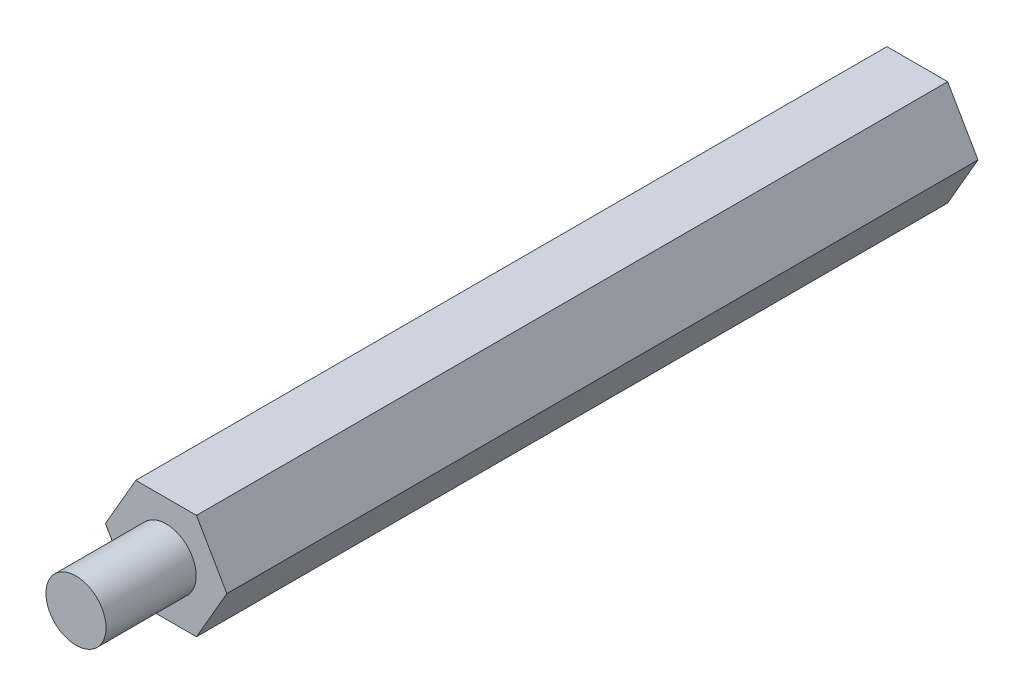
ISO-10303-21;
HEADER;
FILE_DESCRIPTION(('STEP AP214'),'2;1');
FILE_NAME('part.step','',(''),(''),'','','');
FILE_SCHEMA(('AUTOMOTIVE_DESIGN { 1 0 10303 214 1 1 1 1 }'));
ENDSEC;
DATA;
#1=APPLICATION_CONTEXT('core data for automotive mechanical design processes');
#2=APPLICATION_PROTOCOL_DEFINITION('international standard','automotive_design',2000,#1);
#3=PRODUCT_CONTEXT('',#1,'mechanical');
#4=PRODUCT('Part','Part','',(#3));
#5=PRODUCT_RELATED_PRODUCT_CATEGORY('part','',(#4));
#6=PRODUCT_DEFINITION_FORMATION('','',#4);
#7=PRODUCT_DEFINITION_CONTEXT('part definition',#1,'design');
#8=PRODUCT_DEFINITION('design','',#6,#7);
#9=PRODUCT_DEFINITION_SHAPE('','',#8);
#10=(LENGTH_UNIT() NAMED_UNIT(*) SI_UNIT(.MILLI.,.METRE.));
#11=(NAMED_UNIT(*) PLANE_ANGLE_UNIT() SI_UNIT($,.RADIAN.));
#12=(NAMED_UNIT(*) SI_UNIT($,.STERADIAN.) SOLID_ANGLE_UNIT());
#13=UNCERTAINTY_MEASURE_WITH_UNIT(LENGTH_MEASURE(1.E-05),#10,'distance_accuracy_value','');
#14=(GEOMETRIC_REPRESENTATION_CONTEXT(3) GLOBAL_UNCERTAINTY_ASSIGNED_CONTEXT((#13)) GLOBAL_UNIT_ASSIGNED_CONTEXT((#10,
#11,#12)) REPRESENTATION_CONTEXT('',''));
#15=CARTESIAN_POINT('',(0.,0.,0.));
#16=DIRECTION('',(0.,0.,1.));
#17=DIRECTION('',(1.,0.,0.));
#18=AXIS2_PLACEMENT_3D('',#15,#16,#17);
#19=CARTESIAN_POINT('',(2.02072594216373,-3.49999999999998,50.));
#20=DIRECTION('',(-0.866025403784442,0.499999999999995,0.));
#21=DIRECTION('',(-0.499999999999995,-0.866025403784442,0.));
#22=AXIS2_PLACEMENT_3D('',#19,#20,#21);
#23=PLANE('',#22);
#24=DIRECTION('',(0.499999999999995,0.866025403784442,0.));
#25=VECTOR('',#24,1.);
#26=CARTESIAN_POINT('',(2.02072594216373,-3.49999999999998,0.));
#27=LINE('',#26,#25);
#28=CARTESIAN_POINT('',(2.02072594216373,-3.49999999999998,0.));
#29=VERTEX_POINT('',#28);
#30=CARTESIAN_POINT('',(4.04145188432738,0.,0.));
#31=VERTEX_POINT('',#30);
#32=EDGE_CURVE('E126',#29,#31,#27,.T.);
#33=ORIENTED_EDGE('',*,*,#32,.T.);
#34=DIRECTION('',(0.,0.,-1.));
#35=VECTOR('',#34,1.);
#36=CARTESIAN_POINT('',(4.04145188432738,0.,50.));
#37=LINE('',#36,#35);
#38=CARTESIAN_POINT('',(4.04145188432738,0.,50.));
#39=VERTEX_POINT('',#38);
#40=EDGE_CURVE('E41',#39,#31,#37,.T.);
#41=ORIENTED_EDGE('',*,*,#40,.F.);
#42=DIRECTION('',(0.499999999999995,0.866025403784442,0.));
#43=VECTOR('',#42,1.);
#44=CARTESIAN_POINT('',(2.02072594216373,-3.49999999999998,50.));
#45=LINE('',#44,#43);
#46=CARTESIAN_POINT('',(2.02072594216373,-3.49999999999998,50.));
#47=VERTEX_POINT('',#46);
#48=EDGE_CURVE('E137',#47,#39,#45,.T.);
#49=ORIENTED_EDGE('',*,*,#48,.F.);
#50=DIRECTION('',(0.,0.,-1.));
#51=VECTOR('',#50,1.);
#52=CARTESIAN_POINT('',(2.02072594216373,-3.49999999999998,50.));
#53=LINE('',#52,#51);
#54=EDGE_CURVE('E122',#47,#29,#53,.T.);
#55=ORIENTED_EDGE('',*,*,#54,.T.);
#56=EDGE_LOOP('',(#33,#41,#49,#55));
#57=FACE_BOUND('',#56,.T.);
#58=ADVANCED_FACE('F38',(#57),#23,.F.);
#59=CARTESIAN_POINT('',(4.04145188432738,0.,50.));
#60=DIRECTION('',(-0.866025403784438,-0.500000000000001,0.));
#61=DIRECTION('',(0.500000000000001,-0.866025403784438,0.));
#62=AXIS2_PLACEMENT_3D('',#59,#60,#61);
#63=PLANE('',#62);
#64=DIRECTION('',(-0.500000000000001,0.866025403784438,0.));
#65=VECTOR('',#64,1.);
#66=CARTESIAN_POINT('',(4.04145188432738,0.,0.));
#67=LINE('',#66,#65);
#68=CARTESIAN_POINT('',(2.02072594216368,3.50000000000001,0.));
#69=VERTEX_POINT('',#68);
#70=EDGE_CURVE('E129',#31,#69,#67,.T.);
#71=ORIENTED_EDGE('',*,*,#70,.T.);
#72=DIRECTION('',(0.,0.,-1.));
#73=VECTOR('',#72,1.);
#74=CARTESIAN_POINT('',(2.02072594216368,3.50000000000001,50.));
#75=LINE('',#74,#73);
#76=CARTESIAN_POINT('',(2.02072594216368,3.50000000000001,50.));
#77=VERTEX_POINT('',#76);
#78=EDGE_CURVE('E140',#77,#69,#75,.T.);
#79=ORIENTED_EDGE('',*,*,#78,.F.);
#80=DIRECTION('',(-0.500000000000001,0.866025403784438,0.));
#81=VECTOR('',#80,1.);
#82=CARTESIAN_POINT('',(4.04145188432738,0.,50.));
#83=LINE('',#82,#81);
#84=EDGE_CURVE('E94',#39,#77,#83,.T.);
#85=ORIENTED_EDGE('',*,*,#84,.F.);
#86=ORIENTED_EDGE('',*,*,#40,.T.);
#87=EDGE_LOOP('',(#71,#79,#85,#86));
#88=FACE_BOUND('',#87,.T.);
#89=ADVANCED_FACE('F145',(#88),#63,.F.);
#90=CARTESIAN_POINT('',(2.02072594216368,3.50000000000001,50.));
#91=DIRECTION('',(0.,-1.,0.));
#92=DIRECTION('',(1.,0.,0.));
#93=AXIS2_PLACEMENT_3D('',#90,#91,#92);
#94=PLANE('',#93);
#95=DIRECTION('',(-1.,0.,0.));
#96=VECTOR('',#95,1.);
#97=CARTESIAN_POINT('',(2.02072594216368,3.50000000000001,0.));
#98=LINE('',#97,#96);
#99=CARTESIAN_POINT('',(-2.02072594216371,3.49999999999999,0.));
#100=VERTEX_POINT('',#99);
#101=EDGE_CURVE('E132',#69,#100,#98,.T.);
#102=ORIENTED_EDGE('',*,*,#101,.T.);
#103=DIRECTION('',(0.,0.,-1.));
#104=VECTOR('',#103,1.);
#105=CARTESIAN_POINT('',(-2.02072594216371,3.49999999999999,50.));
#106=LINE('',#105,#104);
#107=CARTESIAN_POINT('',(-2.02072594216371,3.49999999999999,50.));
#108=VERTEX_POINT('',#107);
#109=EDGE_CURVE('E117',#108,#100,#106,.T.);
#110=ORIENTED_EDGE('',*,*,#109,.F.);
#111=DIRECTION('',(-1.,0.,0.));
#112=VECTOR('',#111,1.);
#113=CARTESIAN_POINT('',(2.02072594216368,3.50000000000001,50.));
#114=LINE('',#113,#112);
#115=EDGE_CURVE('E108',#77,#108,#114,.T.);
#116=ORIENTED_EDGE('',*,*,#115,.F.);
#117=ORIENTED_EDGE('',*,*,#78,.T.);
#118=EDGE_LOOP('',(#102,#110,#116,#117));
#119=FACE_BOUND('',#118,.T.);
#120=ADVANCED_FACE('F151',(#119),#94,.F.);
#121=CARTESIAN_POINT('',(-2.02072594216371,3.49999999999999,50.));
#122=DIRECTION('',(0.866025403784442,-0.499999999999995,0.));
#123=DIRECTION('',(0.499999999999995,0.866025403784442,0.));
#124=AXIS2_PLACEMENT_3D('',#121,#122,#123);
#125=PLANE('',#124);
#126=DIRECTION('',(-0.499999999999995,-0.866025403784442,0.));
#127=VECTOR('',#126,1.);
#128=CARTESIAN_POINT('',(-2.02072594216371,3.49999999999999,0.));
#129=LINE('',#128,#127);
#130=CARTESIAN_POINT('',(-4.04145188432738,0.,0.));
#131=VERTEX_POINT('',#130);
#132=EDGE_CURVE('E116',#100,#131,#129,.T.);
#133=ORIENTED_EDGE('',*,*,#132,.T.);
#134=DIRECTION('',(0.,0.,-1.));
#135=VECTOR('',#134,1.);
#136=CARTESIAN_POINT('',(-4.04145188432738,0.,50.));
#137=LINE('',#136,#135);
#138=CARTESIAN_POINT('',(-4.04145188432738,0.,50.));
#139=VERTEX_POINT('',#138);
#140=EDGE_CURVE('E113',#139,#131,#137,.T.);
#141=ORIENTED_EDGE('',*,*,#140,.F.);
#142=DIRECTION('',(-0.499999999999995,-0.866025403784442,0.));
#143=VECTOR('',#142,1.);
#144=CARTESIAN_POINT('',(-2.02072594216371,3.49999999999999,50.));
#145=LINE('',#144,#143);
#146=EDGE_CURVE('E102',#108,#139,#145,.T.);
#147=ORIENTED_EDGE('',*,*,#146,.F.);
#148=ORIENTED_EDGE('',*,*,#109,.T.);
#149=EDGE_LOOP('',(#133,#141,#147,#148));
#150=FACE_BOUND('',#149,.T.);
#151=ADVANCED_FACE('F114',(#150),#125,.F.);
#152=CARTESIAN_POINT('',(-4.04145188432738,0.,50.));
#153=DIRECTION('',(0.866025403784435,0.500000000000007,0.));
#154=DIRECTION('',(-0.500000000000007,0.866025403784435,0.));
#155=AXIS2_PLACEMENT_3D('',#152,#153,#154);
#156=PLANE('',#155);
#157=DIRECTION('',(0.500000000000007,-0.866025403784435,0.));
#158=VECTOR('',#157,1.);
#159=CARTESIAN_POINT('',(-4.04145188432738,0.,0.));
#160=LINE('',#159,#158);
#161=CARTESIAN_POINT('',(-2.02072594216366,-3.50000000000002,0.));
#162=VERTEX_POINT('',#161);
#163=EDGE_CURVE('E79',#131,#162,#160,.T.);
#164=ORIENTED_EDGE('',*,*,#163,.T.);
#165=DIRECTION('',(0.,0.,-1.));
#166=VECTOR('',#165,1.);
#167=CARTESIAN_POINT('',(-2.02072594216366,-3.50000000000002,50.));
#168=LINE('',#167,#166);
#169=CARTESIAN_POINT('',(-2.02072594216366,-3.50000000000002,50.));
#170=VERTEX_POINT('',#169);
#171=EDGE_CURVE('E118',#170,#162,#168,.T.);
#172=ORIENTED_EDGE('',*,*,#171,.F.);
#173=DIRECTION('',(0.500000000000007,-0.866025403784435,0.));
#174=VECTOR('',#173,1.);
#175=CARTESIAN_POINT('',(-4.04145188432738,0.,50.));
#176=LINE('',#175,#174);
#177=EDGE_CURVE('E106',#139,#170,#176,.T.);
#178=ORIENTED_EDGE('',*,*,#177,.F.);
#179=ORIENTED_EDGE('',*,*,#140,.T.);
#180=EDGE_LOOP('',(#164,#172,#178,#179));
#181=FACE_BOUND('',#180,.T.);
#182=ADVANCED_FACE('F120',(#181),#156,.F.);
#183=CARTESIAN_POINT('',(-2.02072594216366,-3.50000000000002,50.));
#184=DIRECTION('',(0.,1.,0.));
#185=DIRECTION('',(-1.,0.,0.));
#186=AXIS2_PLACEMENT_3D('',#183,#184,#185);
#187=PLANE('',#186);
#188=DIRECTION('',(1.,0.,0.));
#189=VECTOR('',#188,1.);
#190=CARTESIAN_POINT('',(-2.02072594216366,-3.50000000000002,0.));
#191=LINE('',#190,#189);
#192=EDGE_CURVE('E85',#162,#29,#191,.T.);
#193=ORIENTED_EDGE('',*,*,#192,.T.);
#194=ORIENTED_EDGE('',*,*,#54,.F.);
#195=DIRECTION('',(1.,0.,0.));
#196=VECTOR('',#195,1.);
#197=CARTESIAN_POINT('',(-2.02072594216366,-3.50000000000002,50.));
#198=LINE('',#197,#196);
#199=EDGE_CURVE('E55',#170,#47,#198,.T.);
#200=ORIENTED_EDGE('',*,*,#199,.F.);
#201=ORIENTED_EDGE('',*,*,#171,.T.);
#202=EDGE_LOOP('',(#193,#194,#200,#201));
#203=FACE_BOUND('',#202,.T.);
#204=ADVANCED_FACE('F176',(#203),#187,.F.);
#205=CARTESIAN_POINT('',(0.,0.,50.));
#206=DIRECTION('',(0.,0.,1.));
#207=DIRECTION('',(1.,0.,0.));
#208=AXIS2_PLACEMENT_3D('',#205,#206,#207);
#209=PLANE('',#208);
#210=CARTESIAN_POINT('',(0.,0.,50.));
#211=DIRECTION('',(0.,0.,1.));
#212=DIRECTION('',(1.,0.,0.));
#213=AXIS2_PLACEMENT_3D('',#210,#211,#212);
#214=CIRCLE('',#213,2.);
#215=CARTESIAN_POINT('',(2.,0.,50.));
#216=VERTEX_POINT('',#215);
#217=EDGE_CURVE('E11',#216,#216,#214,.T.);
#218=ORIENTED_EDGE('',*,*,#217,.F.);
#219=EDGE_LOOP('',(#218));
#220=FACE_BOUND('',#219,.T.);
#221=ORIENTED_EDGE('',*,*,#48,.T.);
#222=ORIENTED_EDGE('',*,*,#84,.T.);
#223=ORIENTED_EDGE('',*,*,#115,.T.);
#224=ORIENTED_EDGE('',*,*,#146,.T.);
#225=ORIENTED_EDGE('',*,*,#177,.T.);
#226=ORIENTED_EDGE('',*,*,#199,.T.);
#227=EDGE_LOOP('',(#221,#222,#223,#224,#225,#226));
#228=FACE_BOUND('',#227,.T.);
#229=ADVANCED_FACE('F104',(#220,#228),#209,.T.);
#230=CARTESIAN_POINT('',(0.,0.,0.));
#231=DIRECTION('',(0.,0.,1.));
#232=DIRECTION('',(1.,0.,0.));
#233=AXIS2_PLACEMENT_3D('',#230,#231,#232);
#234=PLANE('',#233);
#235=CARTESIAN_POINT('',(0.,0.,0.));
#236=DIRECTION('',(0.,0.,-1.));
#237=DIRECTION('',(-1.,0.,0.));
#238=AXIS2_PLACEMENT_3D('',#235,#236,#237);
#239=CIRCLE('',#238,1.64999999999999);
#240=CARTESIAN_POINT('',(-1.64999999999999,0.,0.));
#241=VERTEX_POINT('',#240);
#242=EDGE_CURVE('E160',#241,#241,#239,.T.);
#243=ORIENTED_EDGE('',*,*,#242,.F.);
#244=EDGE_LOOP('',(#243));
#245=FACE_BOUND('',#244,.T.);
#246=ORIENTED_EDGE('',*,*,#32,.F.);
#247=ORIENTED_EDGE('',*,*,#192,.F.);
#248=ORIENTED_EDGE('',*,*,#163,.F.);
#249=ORIENTED_EDGE('',*,*,#132,.F.);
#250=ORIENTED_EDGE('',*,*,#101,.F.);
#251=ORIENTED_EDGE('',*,*,#70,.F.);
#252=EDGE_LOOP('',(#246,#247,#248,#249,#250,#251));
#253=FACE_BOUND('',#252,.T.);
#254=ADVANCED_FACE('F150',(#245,#253),#234,.F.);
#255=CARTESIAN_POINT('',(0.,0.,56.));
#256=DIRECTION('',(0.,0.,-1.));
#257=DIRECTION('',(-1.,0.,0.));
#258=AXIS2_PLACEMENT_3D('',#255,#256,#257);
#259=CYLINDRICAL_SURFACE('',#258,2.);
#260=CARTESIAN_POINT('',(0.,0.,56.));
#261=DIRECTION('',(0.,0.,1.));
#262=DIRECTION('',(1.,0.,0.));
#263=AXIS2_PLACEMENT_3D('',#260,#261,#262);
#264=CIRCLE('',#263,2.);
#265=CARTESIAN_POINT('',(2.,0.,56.));
#266=VERTEX_POINT('',#265);
#267=EDGE_CURVE('E130',#266,#266,#264,.T.);
#268=ORIENTED_EDGE('',*,*,#267,.F.);
#269=EDGE_LOOP('',(#268));
#270=FACE_BOUND('',#269,.T.);
#271=ORIENTED_EDGE('',*,*,#217,.T.);
#272=EDGE_LOOP('',(#271));
#273=FACE_BOUND('',#272,.T.);
#274=ADVANCED_FACE('F167',(#270,#273),#259,.T.);
#275=CARTESIAN_POINT('',(0.,0.,56.));
#276=DIRECTION('',(0.,0.,1.));
#277=DIRECTION('',(1.,0.,0.));
#278=AXIS2_PLACEMENT_3D('',#275,#276,#277);
#279=PLANE('',#278);
#280=ORIENTED_EDGE('',*,*,#267,.T.);
#281=EDGE_LOOP('',(#280));
#282=FACE_BOUND('',#281,.T.);
#283=ADVANCED_FACE('F173',(#282),#279,.T.);
#284=CARTESIAN_POINT('',(0.,0.,10.5));
#285=DIRECTION('',(0.,0.,-1.));
#286=DIRECTION('',(-1.,0.,0.));
#287=AXIS2_PLACEMENT_3D('',#284,#285,#286);
#288=CONICAL_SURFACE('',#287,1.65,1.02974425867665);
#289=CARTESIAN_POINT('',(0.,0.,11.4914200213955));
#290=VERTEX_POINT('',#289);
#291=VERTEX_LOOP('',#290);
#292=FACE_BOUND('',#291,.T.);
#293=CARTESIAN_POINT('',(0.,0.,10.5));
#294=DIRECTION('',(0.,0.,-1.));
#295=DIRECTION('',(-1.,0.,0.));
#296=AXIS2_PLACEMENT_3D('',#293,#294,#295);
#297=CIRCLE('',#296,1.65);
#298=CARTESIAN_POINT('',(-1.65,0.,10.5));
#299=VERTEX_POINT('',#298);
#300=EDGE_CURVE('E157',#299,#299,#297,.T.);
#301=ORIENTED_EDGE('',*,*,#300,.T.);
#302=EDGE_LOOP('',(#301));
#303=FACE_BOUND('',#302,.T.);
#304=ADVANCED_FACE('F217',(#292,#303),#288,.F.);
#305=CARTESIAN_POINT('',(0.,0.,0.));
#306=DIRECTION('',(0.,0.,-1.));
#307=DIRECTION('',(-1.,0.,0.));
#308=AXIS2_PLACEMENT_3D('',#305,#306,#307);
#309=CYLINDRICAL_SURFACE('',#308,1.64999999999999);
#310=ORIENTED_EDGE('',*,*,#300,.F.);
#311=EDGE_LOOP('',(#310));
#312=FACE_BOUND('',#311,.T.);
#313=ORIENTED_EDGE('',*,*,#242,.T.);
#314=EDGE_LOOP('',(#313));
#315=FACE_BOUND('',#314,.T.);
#316=ADVANCED_FACE('F164',(#312,#315),#309,.F.);
#317=CLOSED_SHELL('',(#58,#89,#120,#151,#182,#204,#229,#254,#274,#283,#304,#316));
#318=MANIFOLD_SOLID_BREP('B2',#317);
#319=ADVANCED_BREP_SHAPE_REPRESENTATION('',(#18,#318),#14);
#320=SHAPE_DEFINITION_REPRESENTATION(#9,#319);
ENDSEC;
END-ISO-10303-21;
